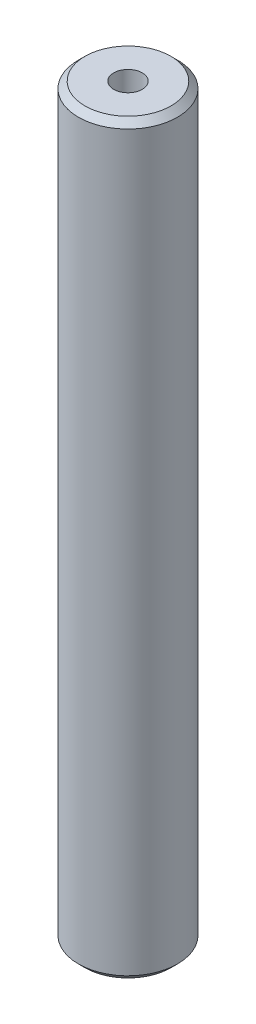
ISO-10303-21;
HEADER;
FILE_DESCRIPTION(('STEP AP214'),'2;1');
FILE_NAME('part.step','',(''),(''),'','','');
FILE_SCHEMA(('AUTOMOTIVE_DESIGN { 1 0 10303 214 1 1 1 1 }'));
ENDSEC;
DATA;
#1=APPLICATION_CONTEXT('core data for automotive mechanical design processes');
#2=APPLICATION_PROTOCOL_DEFINITION('international standard','automotive_design',2000,#1);
#3=PRODUCT_CONTEXT('',#1,'mechanical');
#4=PRODUCT('Part','Part','',(#3));
#5=PRODUCT_RELATED_PRODUCT_CATEGORY('part','',(#4));
#6=PRODUCT_DEFINITION_FORMATION('','',#4);
#7=PRODUCT_DEFINITION_CONTEXT('part definition',#1,'design');
#8=PRODUCT_DEFINITION('design','',#6,#7);
#9=PRODUCT_DEFINITION_SHAPE('','',#8);
#10=(LENGTH_UNIT() NAMED_UNIT(*) SI_UNIT(.MILLI.,.METRE.));
#11=(NAMED_UNIT(*) PLANE_ANGLE_UNIT() SI_UNIT($,.RADIAN.));
#12=(NAMED_UNIT(*) SI_UNIT($,.STERADIAN.) SOLID_ANGLE_UNIT());
#13=UNCERTAINTY_MEASURE_WITH_UNIT(LENGTH_MEASURE(1.E-05),#10,'distance_accuracy_value','');
#14=(GEOMETRIC_REPRESENTATION_CONTEXT(3) GLOBAL_UNCERTAINTY_ASSIGNED_CONTEXT((#13)) GLOBAL_UNIT_ASSIGNED_CONTEXT((#10,
#11,#12)) REPRESENTATION_CONTEXT('',''));
#15=CARTESIAN_POINT('',(0.,0.,0.));
#16=DIRECTION('',(0.,0.,1.));
#17=DIRECTION('',(1.,0.,0.));
#18=AXIS2_PLACEMENT_3D('',#15,#16,#17);
#19=CARTESIAN_POINT('',(0.,452.085628987762,0.));
#20=DIRECTION('',(0.,-1.,0.));
#21=DIRECTION('',(0.,0.,-1.));
#22=AXIS2_PLACEMENT_3D('',#19,#20,#21);
#23=CYLINDRICAL_SURFACE('',#22,30.);
#24=CARTESIAN_POINT('',(0.,448.13625789463,0.));
#25=DIRECTION('',(0.,1.,0.));
#26=DIRECTION('',(0.,0.,1.));
#27=AXIS2_PLACEMENT_3D('',#24,#25,#26);
#28=CIRCLE('',#27,30.);
#29=CARTESIAN_POINT('',(0.,448.13625789463,30.));
#30=VERTEX_POINT('',#29);
#31=EDGE_CURVE('E50',#30,#30,#28,.F.);
#32=ORIENTED_EDGE('',*,*,#31,.T.);
#33=EDGE_LOOP('',(#32));
#34=FACE_BOUND('',#33,.T.);
#35=CARTESIAN_POINT('',(0.,3.94937109313231,0.));
#36=DIRECTION('',(0.,1.,0.));
#37=DIRECTION('',(0.,0.,1.));
#38=AXIS2_PLACEMENT_3D('',#35,#36,#37);
#39=CIRCLE('',#38,30.);
#40=CARTESIAN_POINT('',(0.,3.94937109313231,30.));
#41=VERTEX_POINT('',#40);
#42=EDGE_CURVE('E51',#41,#41,#39,.T.);
#43=ORIENTED_EDGE('',*,*,#42,.T.);
#44=EDGE_LOOP('',(#43));
#45=FACE_BOUND('',#44,.T.);
#46=ADVANCED_FACE('F39',(#34,#45),#23,.T.);
#47=CARTESIAN_POINT('',(0.,452.085628987762,0.));
#48=DIRECTION('',(0.,1.,0.));
#49=DIRECTION('',(0.,0.,1.));
#50=AXIS2_PLACEMENT_3D('',#47,#48,#49);
#51=PLANE('',#50);
#52=CARTESIAN_POINT('',(0.,452.085628987762,0.));
#53=DIRECTION('',(0.,1.,0.));
#54=DIRECTION('',(0.,0.,1.));
#55=AXIS2_PLACEMENT_3D('',#52,#53,#54);
#56=CIRCLE('',#55,26.0506289068677);
#57=CARTESIAN_POINT('',(0.,452.085628987762,26.0506289068677));
#58=VERTEX_POINT('',#57);
#59=EDGE_CURVE('E54',#58,#58,#56,.T.);
#60=ORIENTED_EDGE('',*,*,#59,.T.);
#61=EDGE_LOOP('',(#60));
#62=FACE_BOUND('',#61,.T.);
#63=CARTESIAN_POINT('',(0.,452.085628987762,0.));
#64=DIRECTION('',(0.,1.,0.));
#65=DIRECTION('',(0.,0.,1.));
#66=AXIS2_PLACEMENT_3D('',#63,#64,#65);
#67=CIRCLE('',#66,8.66669355150689);
#68=CARTESIAN_POINT('',(0.,452.085628987762,8.66669355150689));
#69=VERTEX_POINT('',#68);
#70=EDGE_CURVE('E58',#69,#69,#67,.T.);
#71=ORIENTED_EDGE('',*,*,#70,.F.);
#72=EDGE_LOOP('',(#71));
#73=FACE_BOUND('',#72,.T.);
#74=ADVANCED_FACE('F69',(#62,#73),#51,.T.);
#75=CARTESIAN_POINT('',(0.,0.,0.));
#76=DIRECTION('',(0.,1.,0.));
#77=DIRECTION('',(0.,0.,1.));
#78=AXIS2_PLACEMENT_3D('',#75,#76,#77);
#79=PLANE('',#78);
#80=CARTESIAN_POINT('',(0.,0.,0.));
#81=DIRECTION('',(0.,1.,0.));
#82=DIRECTION('',(0.,0.,1.));
#83=AXIS2_PLACEMENT_3D('',#80,#81,#82);
#84=CIRCLE('',#83,26.0506289068677);
#85=CARTESIAN_POINT('',(0.,0.,26.0506289068677));
#86=VERTEX_POINT('',#85);
#87=EDGE_CURVE('E10',#86,#86,#84,.F.);
#88=ORIENTED_EDGE('',*,*,#87,.T.);
#89=EDGE_LOOP('',(#88));
#90=FACE_BOUND('',#89,.T.);
#91=CARTESIAN_POINT('',(0.,0.,0.));
#92=DIRECTION('',(0.,1.,0.));
#93=DIRECTION('',(0.,0.,1.));
#94=AXIS2_PLACEMENT_3D('',#91,#92,#93);
#95=CIRCLE('',#94,8.66669355150689);
#96=CARTESIAN_POINT('',(0.,0.,8.66669355150689));
#97=VERTEX_POINT('',#96);
#98=EDGE_CURVE('E63',#97,#97,#95,.T.);
#99=ORIENTED_EDGE('',*,*,#98,.T.);
#100=EDGE_LOOP('',(#99));
#101=FACE_BOUND('',#100,.T.);
#102=ADVANCED_FACE('F75',(#90,#101),#79,.F.);
#103=CARTESIAN_POINT('',(0.,452.085628987762,0.));
#104=DIRECTION('',(0.,-1.,0.));
#105=DIRECTION('',(0.,0.,-1.));
#106=AXIS2_PLACEMENT_3D('',#103,#104,#105);
#107=CYLINDRICAL_SURFACE('',#106,8.66669355150689);
#108=ORIENTED_EDGE('',*,*,#70,.T.);
#109=EDGE_LOOP('',(#108));
#110=FACE_BOUND('',#109,.T.);
#111=ORIENTED_EDGE('',*,*,#98,.F.);
#112=EDGE_LOOP('',(#111));
#113=FACE_BOUND('',#112,.T.);
#114=ADVANCED_FACE('F70',(#110,#113),#107,.F.);
#115=CARTESIAN_POINT('',(0.,452.085628987762,0.));
#116=DIRECTION('',(0.,-1.,0.));
#117=DIRECTION('',(0.,0.,-1.));
#118=AXIS2_PLACEMENT_3D('',#115,#116,#117);
#119=CONICAL_SURFACE('',#118,26.0506289068677,0.785398163397452);
#120=ORIENTED_EDGE('',*,*,#31,.F.);
#121=EDGE_LOOP('',(#120));
#122=FACE_BOUND('',#121,.T.);
#123=ORIENTED_EDGE('',*,*,#59,.F.);
#124=EDGE_LOOP('',(#123));
#125=FACE_BOUND('',#124,.T.);
#126=ADVANCED_FACE('F81',(#122,#125),#119,.T.);
#127=CARTESIAN_POINT('',(0.,3.94937109313231,0.));
#128=DIRECTION('',(0.,1.,0.));
#129=DIRECTION('',(0.,0.,1.));
#130=AXIS2_PLACEMENT_3D('',#127,#128,#129);
#131=CONICAL_SURFACE('',#130,30.,0.785398163397445);
#132=ORIENTED_EDGE('',*,*,#87,.F.);
#133=EDGE_LOOP('',(#132));
#134=FACE_BOUND('',#133,.T.);
#135=ORIENTED_EDGE('',*,*,#42,.F.);
#136=EDGE_LOOP('',(#135));
#137=FACE_BOUND('',#136,.T.);
#138=ADVANCED_FACE('F45',(#134,#137),#131,.T.);
#139=CLOSED_SHELL('',(#46,#74,#102,#114,#126,#138));
#140=MANIFOLD_SOLID_BREP('B2',#139);
#141=ADVANCED_BREP_SHAPE_REPRESENTATION('',(#18,#140),#14);
#142=SHAPE_DEFINITION_REPRESENTATION(#9,#141);
ENDSEC;
END-ISO-10303-21;
